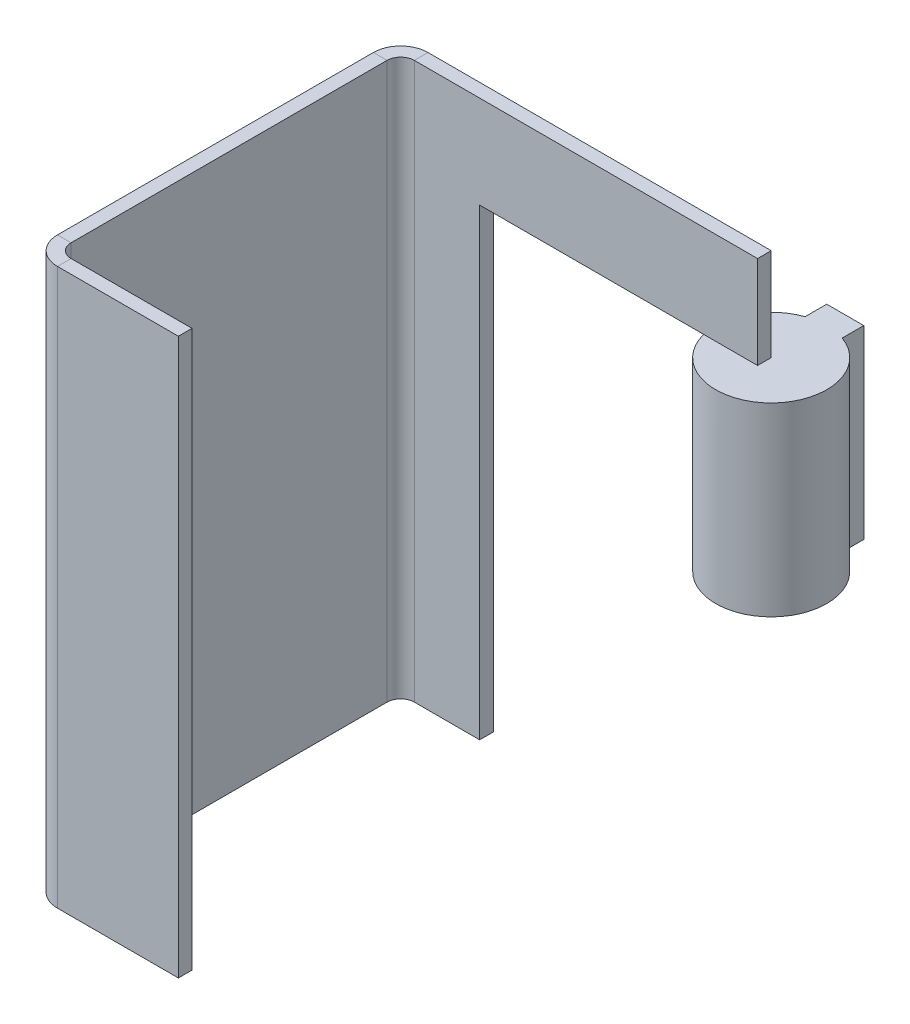
ISO-10303-21;
HEADER;
FILE_DESCRIPTION(('STEP AP214'),'2;1');
FILE_NAME('part.step','',(''),(''),'','','');
FILE_SCHEMA(('AUTOMOTIVE_DESIGN { 1 0 10303 214 1 1 1 1 }'));
ENDSEC;
DATA;
#1=APPLICATION_CONTEXT('core data for automotive mechanical design processes');
#2=APPLICATION_PROTOCOL_DEFINITION('international standard','automotive_design',2000,#1);
#3=PRODUCT_CONTEXT('',#1,'mechanical');
#4=PRODUCT('Part','Part','',(#3));
#5=PRODUCT_RELATED_PRODUCT_CATEGORY('part','',(#4));
#6=PRODUCT_DEFINITION_FORMATION('','',#4);
#7=PRODUCT_DEFINITION_CONTEXT('part definition',#1,'design');
#8=PRODUCT_DEFINITION('design','',#6,#7);
#9=PRODUCT_DEFINITION_SHAPE('','',#8);
#10=(LENGTH_UNIT() NAMED_UNIT(*) SI_UNIT(.MILLI.,.METRE.));
#11=(NAMED_UNIT(*) PLANE_ANGLE_UNIT() SI_UNIT($,.RADIAN.));
#12=(NAMED_UNIT(*) SI_UNIT($,.STERADIAN.) SOLID_ANGLE_UNIT());
#13=UNCERTAINTY_MEASURE_WITH_UNIT(LENGTH_MEASURE(1.E-05),#10,'distance_accuracy_value','');
#14=(GEOMETRIC_REPRESENTATION_CONTEXT(3) GLOBAL_UNCERTAINTY_ASSIGNED_CONTEXT((#13)) GLOBAL_UNIT_ASSIGNED_CONTEXT((#10,
#11,#12)) REPRESENTATION_CONTEXT('',''));
#15=CARTESIAN_POINT('',(0.,0.,0.));
#16=DIRECTION('',(0.,0.,1.));
#17=DIRECTION('',(1.,0.,0.));
#18=AXIS2_PLACEMENT_3D('',#15,#16,#17);
#19=CARTESIAN_POINT('',(0.,30.,-1.4732));
#20=DIRECTION('',(0.,1.,0.));
#21=DIRECTION('',(0.,0.,1.));
#22=AXIS2_PLACEMENT_3D('',#19,#20,#21);
#23=PLANE('',#22);
#24=DIRECTION('',(1.,0.,0.));
#25=VECTOR('',#24,1.);
#26=CARTESIAN_POINT('',(0.,30.,-1.4732));
#27=LINE('',#26,#25);
#28=CARTESIAN_POINT('',(0.,30.,-1.4732));
#29=VERTEX_POINT('',#28);
#30=CARTESIAN_POINT('',(0.7366,30.,-1.4732));
#31=VERTEX_POINT('',#30);
#32=EDGE_CURVE('E12',#29,#31,#27,.T.);
#33=ORIENTED_EDGE('',*,*,#32,.F.);
#34=CARTESIAN_POINT('',(1.4732,30.,-1.4732));
#35=DIRECTION('',(0.,1.,0.));
#36=DIRECTION('',(0.,0.,1.));
#37=AXIS2_PLACEMENT_3D('',#34,#35,#36);
#38=CIRCLE('',#37,1.4732);
#39=CARTESIAN_POINT('',(1.4732,30.,0.));
#40=VERTEX_POINT('',#39);
#41=EDGE_CURVE('E269',#40,#29,#38,.F.);
#42=ORIENTED_EDGE('',*,*,#41,.F.);
#43=DIRECTION('',(0.,0.,1.));
#44=VECTOR('',#43,1.);
#45=CARTESIAN_POINT('',(1.4732,30.,-0.7366));
#46=LINE('',#45,#44);
#47=CARTESIAN_POINT('',(1.4732,30.,-0.7366));
#48=VERTEX_POINT('',#47);
#49=EDGE_CURVE('E58',#48,#40,#46,.T.);
#50=ORIENTED_EDGE('',*,*,#49,.F.);
#51=CARTESIAN_POINT('',(1.4732,30.,-1.4732));
#52=DIRECTION('',(0.,1.,0.));
#53=DIRECTION('',(1.,0.,0.));
#54=AXIS2_PLACEMENT_3D('',#51,#52,#53);
#55=CIRCLE('',#54,0.7366);
#56=EDGE_CURVE('E162',#48,#31,#55,.F.);
#57=ORIENTED_EDGE('',*,*,#56,.T.);
#58=EDGE_LOOP('',(#33,#42,#50,#57));
#59=FACE_BOUND('',#58,.T.);
#60=ADVANCED_FACE('F51',(#59),#23,.T.);
#61=CARTESIAN_POINT('',(1.4732,30.,-0.7366));
#62=DIRECTION('',(0.,1.,0.));
#63=DIRECTION('',(0.,0.,1.));
#64=AXIS2_PLACEMENT_3D('',#61,#62,#63);
#65=PLANE('',#64);
#66=DIRECTION('',(0.,0.,-1.));
#67=VECTOR('',#66,1.);
#68=CARTESIAN_POINT('',(0.,30.,0.));
#69=LINE('',#68,#67);
#70=CARTESIAN_POINT('',(0.,30.,-18.5268));
#71=VERTEX_POINT('',#70);
#72=EDGE_CURVE('E156',#29,#71,#69,.T.);
#73=ORIENTED_EDGE('',*,*,#72,.F.);
#74=ORIENTED_EDGE('',*,*,#32,.T.);
#75=DIRECTION('',(0.,0.,-1.));
#76=VECTOR('',#75,1.);
#77=CARTESIAN_POINT('',(0.7366,30.,0.));
#78=LINE('',#77,#76);
#79=CARTESIAN_POINT('',(0.7366,30.,-18.5268));
#80=VERTEX_POINT('',#79);
#81=EDGE_CURVE('E153',#31,#80,#78,.T.);
#82=ORIENTED_EDGE('',*,*,#81,.T.);
#83=DIRECTION('',(-1.,0.,0.));
#84=VECTOR('',#83,1.);
#85=CARTESIAN_POINT('',(0.7366,30.,-18.5268));
#86=LINE('',#85,#84);
#87=EDGE_CURVE('E250',#80,#71,#86,.T.);
#88=ORIENTED_EDGE('',*,*,#87,.T.);
#89=EDGE_LOOP('',(#73,#74,#82,#88));
#90=FACE_BOUND('',#89,.T.);
#91=ADVANCED_FACE('F151',(#90),#65,.T.);
#92=CARTESIAN_POINT('',(1.4732,0.,0.));
#93=DIRECTION('',(0.,-1.,0.));
#94=DIRECTION('',(0.,0.,-1.));
#95=AXIS2_PLACEMENT_3D('',#92,#93,#94);
#96=PLANE('',#95);
#97=DIRECTION('',(0.,0.,-1.));
#98=VECTOR('',#97,1.);
#99=CARTESIAN_POINT('',(1.4732,0.,0.));
#100=LINE('',#99,#98);
#101=CARTESIAN_POINT('',(1.4732,0.,0.));
#102=VERTEX_POINT('',#101);
#103=CARTESIAN_POINT('',(1.4732,0.,-0.7366));
#104=VERTEX_POINT('',#103);
#105=EDGE_CURVE('E255',#102,#104,#100,.T.);
#106=ORIENTED_EDGE('',*,*,#105,.F.);
#107=CARTESIAN_POINT('',(1.4732,0.,-1.4732));
#108=DIRECTION('',(0.,1.,0.));
#109=DIRECTION('',(0.,0.,1.));
#110=AXIS2_PLACEMENT_3D('',#107,#108,#109);
#111=CIRCLE('',#110,1.4732);
#112=CARTESIAN_POINT('',(0.,0.,-1.4732));
#113=VERTEX_POINT('',#112);
#114=EDGE_CURVE('E205',#102,#113,#111,.F.);
#115=ORIENTED_EDGE('',*,*,#114,.T.);
#116=DIRECTION('',(-1.,0.,0.));
#117=VECTOR('',#116,1.);
#118=CARTESIAN_POINT('',(0.7366,0.,-1.4732));
#119=LINE('',#118,#117);
#120=CARTESIAN_POINT('',(0.7366,0.,-1.4732));
#121=VERTEX_POINT('',#120);
#122=EDGE_CURVE('E253',#121,#113,#119,.T.);
#123=ORIENTED_EDGE('',*,*,#122,.F.);
#124=CARTESIAN_POINT('',(1.4732,0.,-1.4732));
#125=DIRECTION('',(0.,1.,0.));
#126=DIRECTION('',(1.,0.,0.));
#127=AXIS2_PLACEMENT_3D('',#124,#125,#126);
#128=CIRCLE('',#127,0.7366);
#129=EDGE_CURVE('E174',#104,#121,#128,.F.);
#130=ORIENTED_EDGE('',*,*,#129,.F.);
#131=EDGE_LOOP('',(#106,#115,#123,#130));
#132=FACE_BOUND('',#131,.T.);
#133=ADVANCED_FACE('F424',(#132),#96,.T.);
#134=CARTESIAN_POINT('',(0.7366,0.,-1.4732));
#135=DIRECTION('',(0.,-1.,0.));
#136=DIRECTION('',(0.,0.,-1.));
#137=AXIS2_PLACEMENT_3D('',#134,#135,#136);
#138=PLANE('',#137);
#139=DIRECTION('',(-1.,0.,0.));
#140=VECTOR('',#139,1.);
#141=CARTESIAN_POINT('',(8.,0.,0.));
#142=LINE('',#141,#140);
#143=CARTESIAN_POINT('',(8.,0.,0.));
#144=VERTEX_POINT('',#143);
#145=EDGE_CURVE('E208',#144,#102,#142,.T.);
#146=ORIENTED_EDGE('',*,*,#145,.T.);
#147=ORIENTED_EDGE('',*,*,#105,.T.);
#148=DIRECTION('',(-1.,0.,0.));
#149=VECTOR('',#148,1.);
#150=CARTESIAN_POINT('',(8.,0.,-0.736599999999999));
#151=LINE('',#150,#149);
#152=CARTESIAN_POINT('',(8.,0.,-0.736599999999999));
#153=VERTEX_POINT('',#152);
#154=EDGE_CURVE('E214',#153,#104,#151,.T.);
#155=ORIENTED_EDGE('',*,*,#154,.F.);
#156=DIRECTION('',(0.,0.,1.));
#157=VECTOR('',#156,1.);
#158=CARTESIAN_POINT('',(8.,0.,-0.736599999999999));
#159=LINE('',#158,#157);
#160=EDGE_CURVE('E211',#153,#144,#159,.T.);
#161=ORIENTED_EDGE('',*,*,#160,.T.);
#162=EDGE_LOOP('',(#146,#147,#155,#161));
#163=FACE_BOUND('',#162,.T.);
#164=ADVANCED_FACE('F428',(#163),#138,.T.);
#165=CARTESIAN_POINT('',(1.4732,30.,-20.));
#166=DIRECTION('',(0.,1.,0.));
#167=DIRECTION('',(0.,0.,1.));
#168=AXIS2_PLACEMENT_3D('',#165,#166,#167);
#169=PLANE('',#168);
#170=DIRECTION('',(0.,0.,1.));
#171=VECTOR('',#170,1.);
#172=CARTESIAN_POINT('',(1.4732,30.,-20.));
#173=LINE('',#172,#171);
#174=CARTESIAN_POINT('',(1.4732,30.,-20.));
#175=VERTEX_POINT('',#174);
#176=CARTESIAN_POINT('',(1.4732,30.,-19.2634));
#177=VERTEX_POINT('',#176);
#178=EDGE_CURVE('E74',#175,#177,#173,.T.);
#179=ORIENTED_EDGE('',*,*,#178,.F.);
#180=CARTESIAN_POINT('',(1.4732,30.,-18.5268));
#181=DIRECTION('',(0.,1.,0.));
#182=DIRECTION('',(0.,0.,1.));
#183=AXIS2_PLACEMENT_3D('',#180,#181,#182);
#184=CIRCLE('',#183,1.4732);
#185=EDGE_CURVE('E279',#71,#175,#184,.F.);
#186=ORIENTED_EDGE('',*,*,#185,.F.);
#187=ORIENTED_EDGE('',*,*,#87,.F.);
#188=CARTESIAN_POINT('',(1.4732,30.,-18.5268));
#189=DIRECTION('',(0.,1.,0.));
#190=DIRECTION('',(1.,0.,0.));
#191=AXIS2_PLACEMENT_3D('',#188,#189,#190);
#192=CIRCLE('',#191,0.7366);
#193=EDGE_CURVE('E184',#80,#177,#192,.F.);
#194=ORIENTED_EDGE('',*,*,#193,.T.);
#195=EDGE_LOOP('',(#179,#186,#187,#194));
#196=FACE_BOUND('',#195,.T.);
#197=ADVANCED_FACE('F434',(#196),#169,.T.);
#198=CARTESIAN_POINT('',(0.7366,30.,-18.5268));
#199=DIRECTION('',(0.,1.,0.));
#200=DIRECTION('',(0.,0.,1.));
#201=AXIS2_PLACEMENT_3D('',#198,#199,#200);
#202=PLANE('',#201);
#203=DIRECTION('',(1.,0.,0.));
#204=VECTOR('',#203,1.);
#205=CARTESIAN_POINT('',(0.,30.,-20.));
#206=LINE('',#205,#204);
#207=CARTESIAN_POINT('',(20.,30.,-20.));
#208=VERTEX_POINT('',#207);
#209=EDGE_CURVE('E282',#175,#208,#206,.T.);
#210=ORIENTED_EDGE('',*,*,#209,.F.);
#211=ORIENTED_EDGE('',*,*,#178,.T.);
#212=DIRECTION('',(1.,0.,0.));
#213=VECTOR('',#212,1.);
#214=CARTESIAN_POINT('',(0.,30.,-19.2634));
#215=LINE('',#214,#213);
#216=CARTESIAN_POINT('',(20.,30.,-19.2634));
#217=VERTEX_POINT('',#216);
#218=EDGE_CURVE('E222',#177,#217,#215,.T.);
#219=ORIENTED_EDGE('',*,*,#218,.T.);
#220=DIRECTION('',(0.,0.,-1.));
#221=VECTOR('',#220,1.);
#222=CARTESIAN_POINT('',(20.,30.,-19.2634));
#223=LINE('',#222,#221);
#224=EDGE_CURVE('E286',#217,#208,#223,.T.);
#225=ORIENTED_EDGE('',*,*,#224,.T.);
#226=EDGE_LOOP('',(#210,#211,#219,#225));
#227=FACE_BOUND('',#226,.T.);
#228=ADVANCED_FACE('F438',(#227),#202,.T.);
#229=CARTESIAN_POINT('',(0.,0.,-18.5268));
#230=DIRECTION('',(0.,-1.,0.));
#231=DIRECTION('',(0.,0.,-1.));
#232=AXIS2_PLACEMENT_3D('',#229,#230,#231);
#233=PLANE('',#232);
#234=DIRECTION('',(1.,0.,0.));
#235=VECTOR('',#234,1.);
#236=CARTESIAN_POINT('',(0.,0.,-18.5268));
#237=LINE('',#236,#235);
#238=CARTESIAN_POINT('',(0.,0.,-18.5268));
#239=VERTEX_POINT('',#238);
#240=CARTESIAN_POINT('',(0.7366,0.,-18.5268));
#241=VERTEX_POINT('',#240);
#242=EDGE_CURVE('E248',#239,#241,#237,.T.);
#243=ORIENTED_EDGE('',*,*,#242,.F.);
#244=CARTESIAN_POINT('',(1.4732,0.,-18.5268));
#245=DIRECTION('',(0.,1.,0.));
#246=DIRECTION('',(0.,0.,1.));
#247=AXIS2_PLACEMENT_3D('',#244,#245,#246);
#248=CIRCLE('',#247,1.4732);
#249=CARTESIAN_POINT('',(1.4732,0.,-20.));
#250=VERTEX_POINT('',#249);
#251=EDGE_CURVE('E200',#239,#250,#248,.F.);
#252=ORIENTED_EDGE('',*,*,#251,.T.);
#253=DIRECTION('',(0.,0.,-1.));
#254=VECTOR('',#253,1.);
#255=CARTESIAN_POINT('',(1.4732,0.,-19.2634));
#256=LINE('',#255,#254);
#257=CARTESIAN_POINT('',(1.4732,0.,-19.2634));
#258=VERTEX_POINT('',#257);
#259=EDGE_CURVE('E120',#258,#250,#256,.T.);
#260=ORIENTED_EDGE('',*,*,#259,.F.);
#261=CARTESIAN_POINT('',(1.4732,0.,-18.5268));
#262=DIRECTION('',(0.,1.,0.));
#263=DIRECTION('',(1.,0.,0.));
#264=AXIS2_PLACEMENT_3D('',#261,#262,#263);
#265=CIRCLE('',#264,0.7366);
#266=EDGE_CURVE('E220',#241,#258,#265,.F.);
#267=ORIENTED_EDGE('',*,*,#266,.F.);
#268=EDGE_LOOP('',(#243,#252,#260,#267));
#269=FACE_BOUND('',#268,.T.);
#270=ADVANCED_FACE('F441',(#269),#233,.T.);
#271=CARTESIAN_POINT('',(1.4732,0.,-19.2634));
#272=DIRECTION('',(0.,-1.,0.));
#273=DIRECTION('',(0.,0.,-1.));
#274=AXIS2_PLACEMENT_3D('',#271,#272,#273);
#275=PLANE('',#274);
#276=DIRECTION('',(0.,0.,-1.));
#277=VECTOR('',#276,1.);
#278=CARTESIAN_POINT('',(0.,0.,0.));
#279=LINE('',#278,#277);
#280=EDGE_CURVE('E202',#113,#239,#279,.T.);
#281=ORIENTED_EDGE('',*,*,#280,.T.);
#282=ORIENTED_EDGE('',*,*,#242,.T.);
#283=DIRECTION('',(0.,0.,-1.));
#284=VECTOR('',#283,1.);
#285=CARTESIAN_POINT('',(0.7366,0.,0.));
#286=LINE('',#285,#284);
#287=EDGE_CURVE('E218',#121,#241,#286,.T.);
#288=ORIENTED_EDGE('',*,*,#287,.F.);
#289=ORIENTED_EDGE('',*,*,#122,.T.);
#290=EDGE_LOOP('',(#281,#282,#288,#289));
#291=FACE_BOUND('',#290,.T.);
#292=ADVANCED_FACE('F444',(#291),#275,.T.);
#293=CARTESIAN_POINT('',(0.,30.,-19.2634));
#294=DIRECTION('',(0.,0.,-1.));
#295=DIRECTION('',(-1.,0.,0.));
#296=AXIS2_PLACEMENT_3D('',#293,#294,#295);
#297=PLANE('',#296);
#298=DIRECTION('',(1.,0.,0.));
#299=VECTOR('',#298,1.);
#300=CARTESIAN_POINT('',(0.,0.,-19.2634));
#301=LINE('',#300,#299);
#302=CARTESIAN_POINT('',(5.,0.,-19.2634));
#303=VERTEX_POINT('',#302);
#304=EDGE_CURVE('E190',#258,#303,#301,.T.);
#305=ORIENTED_EDGE('',*,*,#304,.T.);
#306=DIRECTION('',(0.,-1.,0.));
#307=VECTOR('',#306,1.);
#308=CARTESIAN_POINT('',(5.,30.,-19.2634));
#309=LINE('',#308,#307);
#310=CARTESIAN_POINT('',(5.,25.,-19.2634));
#311=VERTEX_POINT('',#310);
#312=EDGE_CURVE('E245',#311,#303,#309,.T.);
#313=ORIENTED_EDGE('',*,*,#312,.F.);
#314=DIRECTION('',(-1.,0.,0.));
#315=VECTOR('',#314,1.);
#316=CARTESIAN_POINT('',(5.,25.,-19.2634));
#317=LINE('',#316,#315);
#318=CARTESIAN_POINT('',(17.0918355548559,25.,-19.2634));
#319=VERTEX_POINT('',#318);
#320=EDGE_CURVE('E65',#319,#311,#317,.T.);
#321=ORIENTED_EDGE('',*,*,#320,.F.);
#322=CARTESIAN_POINT('',(20.,25.,-19.2634));
#323=VERTEX_POINT('',#322);
#324=EDGE_CURVE('E290',#323,#319,#317,.T.);
#325=ORIENTED_EDGE('',*,*,#324,.F.);
#326=DIRECTION('',(0.,-1.,0.));
#327=VECTOR('',#326,1.);
#328=CARTESIAN_POINT('',(20.,30.,-19.2634));
#329=LINE('',#328,#327);
#330=EDGE_CURVE('E297',#217,#323,#329,.T.);
#331=ORIENTED_EDGE('',*,*,#330,.F.);
#332=ORIENTED_EDGE('',*,*,#218,.F.);
#333=DIRECTION('',(0.,-1.,0.));
#334=VECTOR('',#333,1.);
#335=CARTESIAN_POINT('',(1.4732,30.,-19.2634));
#336=LINE('',#335,#334);
#337=EDGE_CURVE('E186',#177,#258,#336,.T.);
#338=ORIENTED_EDGE('',*,*,#337,.T.);
#339=EDGE_LOOP('',(#305,#313,#321,#325,#331,#332,#338));
#340=FACE_BOUND('',#339,.T.);
#341=ADVANCED_FACE('F447',(#340),#297,.F.);
#342=CARTESIAN_POINT('',(5.,30.,-20.));
#343=DIRECTION('',(1.,0.,0.));
#344=DIRECTION('',(0.,0.,-1.));
#345=AXIS2_PLACEMENT_3D('',#342,#343,#344);
#346=PLANE('',#345);
#347=DIRECTION('',(0.,0.,-1.));
#348=VECTOR('',#347,1.);
#349=CARTESIAN_POINT('',(5.,25.,-19.2634));
#350=LINE('',#349,#348);
#351=CARTESIAN_POINT('',(5.,25.,-20.));
#352=VERTEX_POINT('',#351);
#353=EDGE_CURVE('E194',#311,#352,#350,.T.);
#354=ORIENTED_EDGE('',*,*,#353,.F.);
#355=ORIENTED_EDGE('',*,*,#312,.T.);
#356=DIRECTION('',(0.,0.,1.));
#357=VECTOR('',#356,1.);
#358=CARTESIAN_POINT('',(5.,0.,-20.));
#359=LINE('',#358,#357);
#360=CARTESIAN_POINT('',(5.,0.,-20.));
#361=VERTEX_POINT('',#360);
#362=EDGE_CURVE('E193',#361,#303,#359,.T.);
#363=ORIENTED_EDGE('',*,*,#362,.F.);
#364=DIRECTION('',(0.,-1.,0.));
#365=VECTOR('',#364,1.);
#366=CARTESIAN_POINT('',(5.,30.,-20.));
#367=LINE('',#366,#365);
#368=EDGE_CURVE('E243',#352,#361,#367,.T.);
#369=ORIENTED_EDGE('',*,*,#368,.F.);
#370=EDGE_LOOP('',(#354,#355,#363,#369));
#371=FACE_BOUND('',#370,.T.);
#372=ADVANCED_FACE('F404',(#371),#346,.T.);
#373=CARTESIAN_POINT('',(0.,30.,-20.));
#374=DIRECTION('',(0.,0.,-1.));
#375=DIRECTION('',(-1.,0.,0.));
#376=AXIS2_PLACEMENT_3D('',#373,#374,#375);
#377=PLANE('',#376);
#378=DIRECTION('',(1.,0.,0.));
#379=VECTOR('',#378,1.);
#380=CARTESIAN_POINT('',(0.,0.,-20.));
#381=LINE('',#380,#379);
#382=EDGE_CURVE('E197',#250,#361,#381,.T.);
#383=ORIENTED_EDGE('',*,*,#382,.F.);
#384=DIRECTION('',(0.,-1.,0.));
#385=VECTOR('',#384,1.);
#386=CARTESIAN_POINT('',(1.4732,30.,-20.));
#387=LINE('',#386,#385);
#388=EDGE_CURVE('E240',#175,#250,#387,.T.);
#389=ORIENTED_EDGE('',*,*,#388,.F.);
#390=ORIENTED_EDGE('',*,*,#209,.T.);
#391=DIRECTION('',(0.,-1.,0.));
#392=VECTOR('',#391,1.);
#393=CARTESIAN_POINT('',(20.,30.,-20.));
#394=LINE('',#393,#392);
#395=CARTESIAN_POINT('',(20.,25.,-20.));
#396=VERTEX_POINT('',#395);
#397=EDGE_CURVE('E299',#208,#396,#394,.T.);
#398=ORIENTED_EDGE('',*,*,#397,.T.);
#399=DIRECTION('',(-1.,0.,0.));
#400=VECTOR('',#399,1.);
#401=CARTESIAN_POINT('',(5.,25.,-20.));
#402=LINE('',#401,#400);
#403=CARTESIAN_POINT('',(17.,25.,-20.));
#404=VERTEX_POINT('',#403);
#405=EDGE_CURVE('E294',#396,#404,#402,.T.);
#406=ORIENTED_EDGE('',*,*,#405,.T.);
#407=EDGE_CURVE('E298',#404,#352,#402,.T.);
#408=ORIENTED_EDGE('',*,*,#407,.T.);
#409=ORIENTED_EDGE('',*,*,#368,.T.);
#410=EDGE_LOOP('',(#383,#389,#390,#398,#406,#408,#409));
#411=FACE_BOUND('',#410,.T.);
#412=ADVANCED_FACE('F401',(#411),#377,.T.);
#413=CARTESIAN_POINT('',(1.4732,30.,-18.5268));
#414=DIRECTION('',(0.,-1.,0.));
#415=DIRECTION('',(0.,0.,-1.));
#416=AXIS2_PLACEMENT_3D('',#413,#414,#415);
#417=CYLINDRICAL_SURFACE('',#416,1.4732);
#418=ORIENTED_EDGE('',*,*,#251,.F.);
#419=DIRECTION('',(0.,-1.,0.));
#420=VECTOR('',#419,1.);
#421=CARTESIAN_POINT('',(0.,30.,-18.5268));
#422=LINE('',#421,#420);
#423=EDGE_CURVE('E237',#71,#239,#422,.T.);
#424=ORIENTED_EDGE('',*,*,#423,.F.);
#425=ORIENTED_EDGE('',*,*,#185,.T.);
#426=ORIENTED_EDGE('',*,*,#388,.T.);
#427=EDGE_LOOP('',(#418,#424,#425,#426));
#428=FACE_BOUND('',#427,.T.);
#429=ADVANCED_FACE('F456',(#428),#417,.T.);
#430=CARTESIAN_POINT('',(0.,30.,0.));
#431=DIRECTION('',(-1.,0.,0.));
#432=DIRECTION('',(0.,0.,1.));
#433=AXIS2_PLACEMENT_3D('',#430,#431,#432);
#434=PLANE('',#433);
#435=ORIENTED_EDGE('',*,*,#280,.F.);
#436=DIRECTION('',(0.,-1.,0.));
#437=VECTOR('',#436,1.);
#438=CARTESIAN_POINT('',(0.,30.,-1.4732));
#439=LINE('',#438,#437);
#440=EDGE_CURVE('E234',#29,#113,#439,.T.);
#441=ORIENTED_EDGE('',*,*,#440,.F.);
#442=ORIENTED_EDGE('',*,*,#72,.T.);
#443=ORIENTED_EDGE('',*,*,#423,.T.);
#444=EDGE_LOOP('',(#435,#441,#442,#443));
#445=FACE_BOUND('',#444,.T.);
#446=ADVANCED_FACE('F459',(#445),#434,.T.);
#447=CARTESIAN_POINT('',(1.4732,30.,-1.4732));
#448=DIRECTION('',(0.,-1.,0.));
#449=DIRECTION('',(0.,0.,-1.));
#450=AXIS2_PLACEMENT_3D('',#447,#448,#449);
#451=CYLINDRICAL_SURFACE('',#450,1.4732);
#452=ORIENTED_EDGE('',*,*,#114,.F.);
#453=DIRECTION('',(0.,-1.,0.));
#454=VECTOR('',#453,1.);
#455=CARTESIAN_POINT('',(1.4732,30.,0.));
#456=LINE('',#455,#454);
#457=EDGE_CURVE('E231',#40,#102,#456,.T.);
#458=ORIENTED_EDGE('',*,*,#457,.F.);
#459=ORIENTED_EDGE('',*,*,#41,.T.);
#460=ORIENTED_EDGE('',*,*,#440,.T.);
#461=EDGE_LOOP('',(#452,#458,#459,#460));
#462=FACE_BOUND('',#461,.T.);
#463=ADVANCED_FACE('F268',(#462),#451,.T.);
#464=CARTESIAN_POINT('',(8.,30.,0.));
#465=DIRECTION('',(0.,0.,1.));
#466=DIRECTION('',(1.,0.,0.));
#467=AXIS2_PLACEMENT_3D('',#464,#465,#466);
#468=PLANE('',#467);
#469=ORIENTED_EDGE('',*,*,#145,.F.);
#470=DIRECTION('',(0.,-1.,0.));
#471=VECTOR('',#470,1.);
#472=CARTESIAN_POINT('',(8.,30.,0.));
#473=LINE('',#472,#471);
#474=CARTESIAN_POINT('',(8.,30.,0.));
#475=VERTEX_POINT('',#474);
#476=EDGE_CURVE('E229',#475,#144,#473,.T.);
#477=ORIENTED_EDGE('',*,*,#476,.F.);
#478=DIRECTION('',(-1.,0.,0.));
#479=VECTOR('',#478,1.);
#480=CARTESIAN_POINT('',(8.,30.,0.));
#481=LINE('',#480,#479);
#482=EDGE_CURVE('E262',#475,#40,#481,.T.);
#483=ORIENTED_EDGE('',*,*,#482,.T.);
#484=ORIENTED_EDGE('',*,*,#457,.T.);
#485=EDGE_LOOP('',(#469,#477,#483,#484));
#486=FACE_BOUND('',#485,.T.);
#487=ADVANCED_FACE('F273',(#486),#468,.T.);
#488=CARTESIAN_POINT('',(8.,30.,-0.736599999999999));
#489=DIRECTION('',(1.,0.,0.));
#490=DIRECTION('',(0.,0.,-1.));
#491=AXIS2_PLACEMENT_3D('',#488,#489,#490);
#492=PLANE('',#491);
#493=ORIENTED_EDGE('',*,*,#160,.F.);
#494=DIRECTION('',(0.,-1.,0.));
#495=VECTOR('',#494,1.);
#496=CARTESIAN_POINT('',(8.,30.,-0.736599999999999));
#497=LINE('',#496,#495);
#498=CARTESIAN_POINT('',(8.,30.,-0.736599999999999));
#499=VERTEX_POINT('',#498);
#500=EDGE_CURVE('E227',#499,#153,#497,.T.);
#501=ORIENTED_EDGE('',*,*,#500,.F.);
#502=DIRECTION('',(0.,0.,1.));
#503=VECTOR('',#502,1.);
#504=CARTESIAN_POINT('',(8.,30.,-0.736599999999999));
#505=LINE('',#504,#503);
#506=EDGE_CURVE('E274',#499,#475,#505,.T.);
#507=ORIENTED_EDGE('',*,*,#506,.T.);
#508=ORIENTED_EDGE('',*,*,#476,.T.);
#509=EDGE_LOOP('',(#493,#501,#507,#508));
#510=FACE_BOUND('',#509,.T.);
#511=ADVANCED_FACE('F468',(#510),#492,.T.);
#512=CARTESIAN_POINT('',(8.,30.,-0.736599999999999));
#513=DIRECTION('',(0.,0.,1.));
#514=DIRECTION('',(1.,0.,0.));
#515=AXIS2_PLACEMENT_3D('',#512,#513,#514);
#516=PLANE('',#515);
#517=ORIENTED_EDGE('',*,*,#154,.T.);
#518=DIRECTION('',(0.,-1.,0.));
#519=VECTOR('',#518,1.);
#520=CARTESIAN_POINT('',(1.4732,30.,-0.7366));
#521=LINE('',#520,#519);
#522=EDGE_CURVE('E178',#48,#104,#521,.T.);
#523=ORIENTED_EDGE('',*,*,#522,.F.);
#524=DIRECTION('',(-1.,0.,0.));
#525=VECTOR('',#524,1.);
#526=CARTESIAN_POINT('',(8.,30.,-0.736599999999999));
#527=LINE('',#526,#525);
#528=EDGE_CURVE('E167',#499,#48,#527,.T.);
#529=ORIENTED_EDGE('',*,*,#528,.F.);
#530=ORIENTED_EDGE('',*,*,#500,.T.);
#531=EDGE_LOOP('',(#517,#523,#529,#530));
#532=FACE_BOUND('',#531,.T.);
#533=ADVANCED_FACE('F471',(#532),#516,.F.);
#534=CARTESIAN_POINT('',(1.4732,30.,-1.4732));
#535=DIRECTION('',(0.,-1.,0.));
#536=DIRECTION('',(0.,0.,-1.));
#537=AXIS2_PLACEMENT_3D('',#534,#535,#536);
#538=CYLINDRICAL_SURFACE('',#537,0.7366);
#539=ORIENTED_EDGE('',*,*,#129,.T.);
#540=DIRECTION('',(0.,-1.,0.));
#541=VECTOR('',#540,1.);
#542=CARTESIAN_POINT('',(0.7366,30.,-1.4732));
#543=LINE('',#542,#541);
#544=EDGE_CURVE('E171',#31,#121,#543,.T.);
#545=ORIENTED_EDGE('',*,*,#544,.F.);
#546=ORIENTED_EDGE('',*,*,#56,.F.);
#547=ORIENTED_EDGE('',*,*,#522,.T.);
#548=EDGE_LOOP('',(#539,#545,#546,#547));
#549=FACE_BOUND('',#548,.T.);
#550=ADVANCED_FACE('F172',(#549),#538,.F.);
#551=CARTESIAN_POINT('',(0.7366,30.,0.));
#552=DIRECTION('',(-1.,0.,0.));
#553=DIRECTION('',(0.,0.,1.));
#554=AXIS2_PLACEMENT_3D('',#551,#552,#553);
#555=PLANE('',#554);
#556=ORIENTED_EDGE('',*,*,#287,.T.);
#557=DIRECTION('',(0.,-1.,0.));
#558=VECTOR('',#557,1.);
#559=CARTESIAN_POINT('',(0.7366,30.,-18.5268));
#560=LINE('',#559,#558);
#561=EDGE_CURVE('E179',#80,#241,#560,.T.);
#562=ORIENTED_EDGE('',*,*,#561,.F.);
#563=ORIENTED_EDGE('',*,*,#81,.F.);
#564=ORIENTED_EDGE('',*,*,#544,.T.);
#565=EDGE_LOOP('',(#556,#562,#563,#564));
#566=FACE_BOUND('',#565,.T.);
#567=ADVANCED_FACE('F181',(#566),#555,.F.);
#568=CARTESIAN_POINT('',(1.4732,30.,-18.5268));
#569=DIRECTION('',(0.,-1.,0.));
#570=DIRECTION('',(0.,0.,-1.));
#571=AXIS2_PLACEMENT_3D('',#568,#569,#570);
#572=CYLINDRICAL_SURFACE('',#571,0.7366);
#573=ORIENTED_EDGE('',*,*,#266,.T.);
#574=ORIENTED_EDGE('',*,*,#337,.F.);
#575=ORIENTED_EDGE('',*,*,#193,.F.);
#576=ORIENTED_EDGE('',*,*,#561,.T.);
#577=EDGE_LOOP('',(#573,#574,#575,#576));
#578=FACE_BOUND('',#577,.T.);
#579=ADVANCED_FACE('F480',(#578),#572,.F.);
#580=CARTESIAN_POINT('',(1.4732,30.,-18.5268));
#581=DIRECTION('',(0.,1.,0.));
#582=DIRECTION('',(1.,0.,0.));
#583=AXIS2_PLACEMENT_3D('',#580,#581,#582);
#584=PLANE('',#583);
#585=ORIENTED_EDGE('',*,*,#528,.T.);
#586=ORIENTED_EDGE('',*,*,#49,.T.);
#587=ORIENTED_EDGE('',*,*,#482,.F.);
#588=ORIENTED_EDGE('',*,*,#506,.F.);
#589=EDGE_LOOP('',(#585,#586,#587,#588));
#590=FACE_BOUND('',#589,.T.);
#591=ADVANCED_FACE('F259',(#590),#584,.T.);
#592=CARTESIAN_POINT('',(1.4732,0.,-18.5268));
#593=DIRECTION('',(0.,1.,0.));
#594=DIRECTION('',(1.,0.,0.));
#595=AXIS2_PLACEMENT_3D('',#592,#593,#594);
#596=PLANE('',#595);
#597=ORIENTED_EDGE('',*,*,#304,.F.);
#598=ORIENTED_EDGE('',*,*,#259,.T.);
#599=ORIENTED_EDGE('',*,*,#382,.T.);
#600=ORIENTED_EDGE('',*,*,#362,.T.);
#601=EDGE_LOOP('',(#597,#598,#599,#600));
#602=FACE_BOUND('',#601,.T.);
#603=ADVANCED_FACE('F409',(#602),#596,.F.);
#604=CARTESIAN_POINT('',(5.,25.,-19.2634));
#605=DIRECTION('',(0.,-1.,0.));
#606=DIRECTION('',(1.,0.,0.));
#607=AXIS2_PLACEMENT_3D('',#604,#605,#606);
#608=PLANE('',#607);
#609=ORIENTED_EDGE('',*,*,#407,.F.);
#610=CARTESIAN_POINT('',(20.,25.,-20.));
#611=DIRECTION('',(0.,-1.,0.));
#612=DIRECTION('',(1.,0.,0.));
#613=AXIS2_PLACEMENT_3D('',#610,#611,#612);
#614=CIRCLE('',#613,3.);
#615=EDGE_CURVE('E317',#319,#404,#614,.T.);
#616=ORIENTED_EDGE('',*,*,#615,.F.);
#617=ORIENTED_EDGE('',*,*,#320,.T.);
#618=ORIENTED_EDGE('',*,*,#353,.T.);
#619=EDGE_LOOP('',(#609,#616,#617,#618));
#620=FACE_BOUND('',#619,.T.);
#621=ADVANCED_FACE('F406',(#620),#608,.T.);
#622=CARTESIAN_POINT('',(20.,30.,-19.2634));
#623=DIRECTION('',(1.,0.,0.));
#624=DIRECTION('',(0.,0.,-1.));
#625=AXIS2_PLACEMENT_3D('',#622,#623,#624);
#626=PLANE('',#625);
#627=ORIENTED_EDGE('',*,*,#397,.F.);
#628=ORIENTED_EDGE('',*,*,#224,.F.);
#629=ORIENTED_EDGE('',*,*,#330,.T.);
#630=DIRECTION('',(0.,0.,-1.));
#631=VECTOR('',#630,1.);
#632=CARTESIAN_POINT('',(20.,25.,-19.2634));
#633=LINE('',#632,#631);
#634=EDGE_CURVE('E289',#323,#396,#633,.T.);
#635=ORIENTED_EDGE('',*,*,#634,.T.);
#636=EDGE_LOOP('',(#627,#628,#629,#635));
#637=FACE_BOUND('',#636,.T.);
#638=ADVANCED_FACE('F408',(#637),#626,.T.);
#639=CARTESIAN_POINT('',(0.,25.,0.));
#640=DIRECTION('',(0.,1.,0.));
#641=DIRECTION('',(0.,0.,1.));
#642=AXIS2_PLACEMENT_3D('',#639,#640,#641);
#643=PLANE('',#642);
#644=ORIENTED_EDGE('',*,*,#324,.T.);
#645=CARTESIAN_POINT('',(21.,25.,-22.8284271247462));
#646=VERTEX_POINT('',#645);
#647=EDGE_CURVE('E313',#646,#319,#614,.T.);
#648=ORIENTED_EDGE('',*,*,#647,.F.);
#649=DIRECTION('',(0.,0.,-1.));
#650=VECTOR('',#649,1.);
#651=CARTESIAN_POINT('',(21.,25.,-22.003201281025));
#652=LINE('',#651,#650);
#653=CARTESIAN_POINT('',(21.,25.,-23.996798718975));
#654=VERTEX_POINT('',#653);
#655=EDGE_CURVE('E321',#646,#654,#652,.T.);
#656=ORIENTED_EDGE('',*,*,#655,.T.);
#657=DIRECTION('',(-1.,0.,0.));
#658=VECTOR('',#657,1.);
#659=CARTESIAN_POINT('',(21.,25.,-23.996798718975));
#660=LINE('',#659,#658);
#661=CARTESIAN_POINT('',(19.,25.,-23.996798718975));
#662=VERTEX_POINT('',#661);
#663=EDGE_CURVE('E332',#654,#662,#660,.T.);
#664=ORIENTED_EDGE('',*,*,#663,.T.);
#665=DIRECTION('',(0.,0.,-1.));
#666=VECTOR('',#665,1.);
#667=CARTESIAN_POINT('',(19.,25.,-22.003201281025));
#668=LINE('',#667,#666);
#669=CARTESIAN_POINT('',(19.,25.,-22.8284271247462));
#670=VERTEX_POINT('',#669);
#671=EDGE_CURVE('E328',#670,#662,#668,.T.);
#672=ORIENTED_EDGE('',*,*,#671,.F.);
#673=EDGE_CURVE('E318',#404,#670,#614,.T.);
#674=ORIENTED_EDGE('',*,*,#673,.F.);
#675=ORIENTED_EDGE('',*,*,#405,.F.);
#676=ORIENTED_EDGE('',*,*,#634,.F.);
#677=EDGE_LOOP('',(#644,#648,#656,#664,#672,#674,#675,#676));
#678=FACE_BOUND('',#677,.T.);
#679=ADVANCED_FACE('F373',(#678),#643,.T.);
#680=CARTESIAN_POINT('',(21.,15.,-23.996798718975));
#681=DIRECTION('',(0.,0.,-1.));
#682=DIRECTION('',(-1.,0.,0.));
#683=AXIS2_PLACEMENT_3D('',#680,#681,#682);
#684=PLANE('',#683);
#685=ORIENTED_EDGE('',*,*,#663,.F.);
#686=DIRECTION('',(0.,1.,0.));
#687=VECTOR('',#686,1.);
#688=CARTESIAN_POINT('',(21.,15.,-23.996798718975));
#689=LINE('',#688,#687);
#690=CARTESIAN_POINT('',(21.,15.,-23.996798718975));
#691=VERTEX_POINT('',#690);
#692=EDGE_CURVE('E322',#691,#654,#689,.T.);
#693=ORIENTED_EDGE('',*,*,#692,.F.);
#694=DIRECTION('',(-1.,0.,0.));
#695=VECTOR('',#694,1.);
#696=CARTESIAN_POINT('',(21.,15.,-23.996798718975));
#697=LINE('',#696,#695);
#698=CARTESIAN_POINT('',(19.,15.,-23.996798718975));
#699=VERTEX_POINT('',#698);
#700=EDGE_CURVE('E339',#691,#699,#697,.T.);
#701=ORIENTED_EDGE('',*,*,#700,.T.);
#702=DIRECTION('',(0.,1.,0.));
#703=VECTOR('',#702,1.);
#704=CARTESIAN_POINT('',(19.,15.,-23.996798718975));
#705=LINE('',#704,#703);
#706=EDGE_CURVE('E312',#699,#662,#705,.T.);
#707=ORIENTED_EDGE('',*,*,#706,.T.);
#708=EDGE_LOOP('',(#685,#693,#701,#707));
#709=FACE_BOUND('',#708,.T.);
#710=ADVANCED_FACE('F360',(#709),#684,.T.);
#711=CARTESIAN_POINT('',(21.,15.,-22.003201281025));
#712=DIRECTION('',(1.,0.,0.));
#713=DIRECTION('',(0.,1.,0.));
#714=AXIS2_PLACEMENT_3D('',#711,#712,#713);
#715=PLANE('',#714);
#716=ORIENTED_EDGE('',*,*,#655,.F.);
#717=DIRECTION('',(0.,1.,0.));
#718=VECTOR('',#717,1.);
#719=CARTESIAN_POINT('',(21.,15.,-22.8284271247462));
#720=LINE('',#719,#718);
#721=CARTESIAN_POINT('',(21.,15.,-22.8284271247462));
#722=VERTEX_POINT('',#721);
#723=EDGE_CURVE('E302',#646,#722,#720,.F.);
#724=ORIENTED_EDGE('',*,*,#723,.T.);
#725=DIRECTION('',(0.,0.,-1.));
#726=VECTOR('',#725,1.);
#727=CARTESIAN_POINT('',(21.,15.,-22.003201281025));
#728=LINE('',#727,#726);
#729=EDGE_CURVE('E331',#722,#691,#728,.T.);
#730=ORIENTED_EDGE('',*,*,#729,.T.);
#731=ORIENTED_EDGE('',*,*,#692,.T.);
#732=EDGE_LOOP('',(#716,#724,#730,#731));
#733=FACE_BOUND('',#732,.T.);
#734=ADVANCED_FACE('F348',(#733),#715,.T.);
#735=CARTESIAN_POINT('',(19.,15.,-22.003201281025));
#736=DIRECTION('',(1.,0.,0.));
#737=DIRECTION('',(0.,1.,0.));
#738=AXIS2_PLACEMENT_3D('',#735,#736,#737);
#739=PLANE('',#738);
#740=DIRECTION('',(0.,1.,0.));
#741=VECTOR('',#740,1.);
#742=CARTESIAN_POINT('',(19.,15.,-22.8284271247462));
#743=LINE('',#742,#741);
#744=CARTESIAN_POINT('',(19.,15.,-22.8284271247462));
#745=VERTEX_POINT('',#744);
#746=EDGE_CURVE('E309',#670,#745,#743,.F.);
#747=ORIENTED_EDGE('',*,*,#746,.F.);
#748=ORIENTED_EDGE('',*,*,#671,.T.);
#749=ORIENTED_EDGE('',*,*,#706,.F.);
#750=DIRECTION('',(0.,0.,-1.));
#751=VECTOR('',#750,1.);
#752=CARTESIAN_POINT('',(19.,15.,-22.003201281025));
#753=LINE('',#752,#751);
#754=EDGE_CURVE('E325',#745,#699,#753,.T.);
#755=ORIENTED_EDGE('',*,*,#754,.F.);
#756=EDGE_LOOP('',(#747,#748,#749,#755));
#757=FACE_BOUND('',#756,.T.);
#758=ADVANCED_FACE('F369',(#757),#739,.F.);
#759=CARTESIAN_POINT('',(0.,15.,0.));
#760=DIRECTION('',(0.,1.,0.));
#761=DIRECTION('',(0.,0.,1.));
#762=AXIS2_PLACEMENT_3D('',#759,#760,#761);
#763=PLANE('',#762);
#764=ORIENTED_EDGE('',*,*,#729,.F.);
#765=CARTESIAN_POINT('',(20.,15.,-20.));
#766=DIRECTION('',(0.,-1.,0.));
#767=DIRECTION('',(1.,0.,0.));
#768=AXIS2_PLACEMENT_3D('',#765,#766,#767);
#769=CIRCLE('',#768,3.);
#770=EDGE_CURVE('E316',#722,#745,#769,.T.);
#771=ORIENTED_EDGE('',*,*,#770,.T.);
#772=ORIENTED_EDGE('',*,*,#754,.T.);
#773=ORIENTED_EDGE('',*,*,#700,.F.);
#774=EDGE_LOOP('',(#764,#771,#772,#773));
#775=FACE_BOUND('',#774,.T.);
#776=ADVANCED_FACE('F361',(#775),#763,.F.);
#777=CARTESIAN_POINT('',(20.,15.,-20.));
#778=DIRECTION('',(0.,1.,0.));
#779=DIRECTION('',(-1.,0.,0.));
#780=AXIS2_PLACEMENT_3D('',#777,#778,#779);
#781=CYLINDRICAL_SURFACE('',#780,3.);
#782=ORIENTED_EDGE('',*,*,#723,.F.);
#783=ORIENTED_EDGE('',*,*,#647,.T.);
#784=ORIENTED_EDGE('',*,*,#615,.T.);
#785=ORIENTED_EDGE('',*,*,#673,.T.);
#786=ORIENTED_EDGE('',*,*,#746,.T.);
#787=ORIENTED_EDGE('',*,*,#770,.F.);
#788=EDGE_LOOP('',(#782,#783,#784,#785,#786,#787));
#789=FACE_BOUND('',#788,.T.);
#790=ADVANCED_FACE('F577',(#789),#781,.T.);
#791=CLOSED_SHELL('',(#60,#91,#133,#164,#197,#228,#270,#292,#341,#372,#412,#429,#446,#463,#487,
#511,#533,#550,#567,#579,#591,#603,#621,#638,#679,#710,#734,#758,#776,#790));
#792=MANIFOLD_SOLID_BREP('B2',#791);
#793=ADVANCED_BREP_SHAPE_REPRESENTATION('',(#18,#792),#14);
#794=SHAPE_DEFINITION_REPRESENTATION(#9,#793);
ENDSEC;
END-ISO-10303-21;
